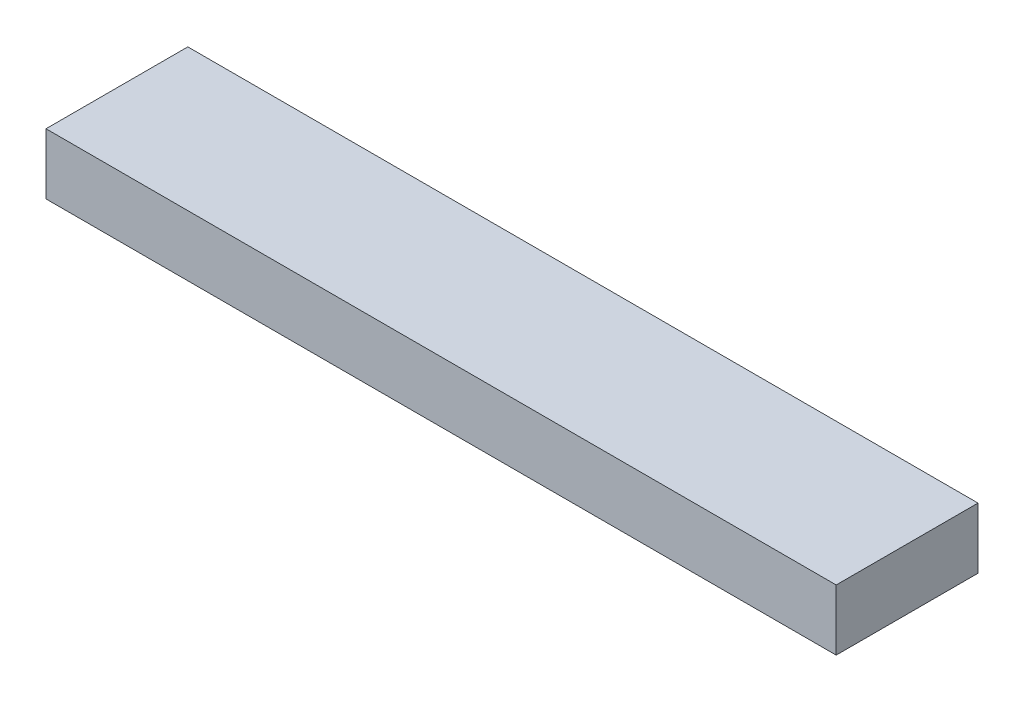
ISO-10303-21;
HEADER;
FILE_DESCRIPTION(('STEP AP214'),'2;1');
FILE_NAME('part.step','',(''),(''),'','','');
FILE_SCHEMA(('AUTOMOTIVE_DESIGN { 1 0 10303 214 1 1 1 1 }'));
ENDSEC;
DATA;
#1=APPLICATION_CONTEXT('core data for automotive mechanical design processes');
#2=APPLICATION_PROTOCOL_DEFINITION('international standard','automotive_design',2000,#1);
#3=PRODUCT_CONTEXT('',#1,'mechanical');
#4=PRODUCT('Part','Part','',(#3));
#5=PRODUCT_RELATED_PRODUCT_CATEGORY('part','',(#4));
#6=PRODUCT_DEFINITION_FORMATION('','',#4);
#7=PRODUCT_DEFINITION_CONTEXT('part definition',#1,'design');
#8=PRODUCT_DEFINITION('design','',#6,#7);
#9=PRODUCT_DEFINITION_SHAPE('','',#8);
#10=(LENGTH_UNIT() NAMED_UNIT(*) SI_UNIT(.MILLI.,.METRE.));
#11=(NAMED_UNIT(*) PLANE_ANGLE_UNIT() SI_UNIT($,.RADIAN.));
#12=(NAMED_UNIT(*) SI_UNIT($,.STERADIAN.) SOLID_ANGLE_UNIT());
#13=UNCERTAINTY_MEASURE_WITH_UNIT(LENGTH_MEASURE(1.E-05),#10,'distance_accuracy_value','');
#14=(GEOMETRIC_REPRESENTATION_CONTEXT(3) GLOBAL_UNCERTAINTY_ASSIGNED_CONTEXT((#13)) GLOBAL_UNIT_ASSIGNED_CONTEXT((#10,
#11,#12)) REPRESENTATION_CONTEXT('',''));
#15=CARTESIAN_POINT('',(0.,0.,0.));
#16=DIRECTION('',(0.,0.,1.));
#17=DIRECTION('',(1.,0.,0.));
#18=AXIS2_PLACEMENT_3D('',#15,#16,#17);
#19=CARTESIAN_POINT('',(0.,38.1,0.));
#20=DIRECTION('',(1.,0.,0.));
#21=DIRECTION('',(0.,0.,-1.));
#22=AXIS2_PLACEMENT_3D('',#19,#20,#21);
#23=PLANE('',#22);
#24=DIRECTION('',(0.,0.,1.));
#25=VECTOR('',#24,1.);
#26=CARTESIAN_POINT('',(0.,0.,0.));
#27=LINE('',#26,#25);
#28=CARTESIAN_POINT('',(0.,0.,-88.9));
#29=VERTEX_POINT('',#28);
#30=CARTESIAN_POINT('',(0.,0.,0.));
#31=VERTEX_POINT('',#30);
#32=EDGE_CURVE('E93',#29,#31,#27,.T.);
#33=ORIENTED_EDGE('',*,*,#32,.T.);
#34=DIRECTION('',(0.,-1.,0.));
#35=VECTOR('',#34,1.);
#36=CARTESIAN_POINT('',(0.,38.1,0.));
#37=LINE('',#36,#35);
#38=CARTESIAN_POINT('',(0.,38.1,0.));
#39=VERTEX_POINT('',#38);
#40=EDGE_CURVE('E11',#39,#31,#37,.T.);
#41=ORIENTED_EDGE('',*,*,#40,.F.);
#42=DIRECTION('',(0.,0.,1.));
#43=VECTOR('',#42,1.);
#44=CARTESIAN_POINT('',(0.,38.1,0.));
#45=LINE('',#44,#43);
#46=CARTESIAN_POINT('',(0.,38.1,-88.9));
#47=VERTEX_POINT('',#46);
#48=EDGE_CURVE('E81',#47,#39,#45,.T.);
#49=ORIENTED_EDGE('',*,*,#48,.F.);
#50=DIRECTION('',(0.,-1.,0.));
#51=VECTOR('',#50,1.);
#52=CARTESIAN_POINT('',(0.,38.1,-88.9));
#53=LINE('',#52,#51);
#54=EDGE_CURVE('E89',#47,#29,#53,.T.);
#55=ORIENTED_EDGE('',*,*,#54,.T.);
#56=EDGE_LOOP('',(#33,#41,#49,#55));
#57=FACE_BOUND('',#56,.T.);
#58=ADVANCED_FACE('F30',(#57),#23,.F.);
#59=CARTESIAN_POINT('',(0.,38.1,0.));
#60=DIRECTION('',(0.,0.,-1.));
#61=DIRECTION('',(-1.,0.,0.));
#62=AXIS2_PLACEMENT_3D('',#59,#60,#61);
#63=PLANE('',#62);
#64=DIRECTION('',(1.,0.,0.));
#65=VECTOR('',#64,1.);
#66=CARTESIAN_POINT('',(0.,0.,0.));
#67=LINE('',#66,#65);
#68=CARTESIAN_POINT('',(495.3,0.,0.));
#69=VERTEX_POINT('',#68);
#70=EDGE_CURVE('E85',#31,#69,#67,.T.);
#71=ORIENTED_EDGE('',*,*,#70,.T.);
#72=DIRECTION('',(0.,-1.,0.));
#73=VECTOR('',#72,1.);
#74=CARTESIAN_POINT('',(495.3,38.1,0.));
#75=LINE('',#74,#73);
#76=CARTESIAN_POINT('',(495.3,38.1,0.));
#77=VERTEX_POINT('',#76);
#78=EDGE_CURVE('E38',#77,#69,#75,.T.);
#79=ORIENTED_EDGE('',*,*,#78,.F.);
#80=DIRECTION('',(1.,0.,0.));
#81=VECTOR('',#80,1.);
#82=CARTESIAN_POINT('',(0.,38.1,0.));
#83=LINE('',#82,#81);
#84=EDGE_CURVE('E76',#39,#77,#83,.T.);
#85=ORIENTED_EDGE('',*,*,#84,.F.);
#86=ORIENTED_EDGE('',*,*,#40,.T.);
#87=EDGE_LOOP('',(#71,#79,#85,#86));
#88=FACE_BOUND('',#87,.T.);
#89=ADVANCED_FACE('F84',(#88),#63,.F.);
#90=CARTESIAN_POINT('',(495.3,38.1,0.));
#91=DIRECTION('',(-1.,0.,0.));
#92=DIRECTION('',(0.,0.,1.));
#93=AXIS2_PLACEMENT_3D('',#90,#91,#92);
#94=PLANE('',#93);
#95=DIRECTION('',(0.,0.,-1.));
#96=VECTOR('',#95,1.);
#97=CARTESIAN_POINT('',(495.3,0.,0.));
#98=LINE('',#97,#96);
#99=CARTESIAN_POINT('',(495.3,0.,-88.9));
#100=VERTEX_POINT('',#99);
#101=EDGE_CURVE('E63',#69,#100,#98,.T.);
#102=ORIENTED_EDGE('',*,*,#101,.T.);
#103=DIRECTION('',(0.,-1.,0.));
#104=VECTOR('',#103,1.);
#105=CARTESIAN_POINT('',(495.3,38.1,-88.9));
#106=LINE('',#105,#104);
#107=CARTESIAN_POINT('',(495.3,38.1,-88.9));
#108=VERTEX_POINT('',#107);
#109=EDGE_CURVE('E86',#108,#100,#106,.T.);
#110=ORIENTED_EDGE('',*,*,#109,.F.);
#111=DIRECTION('',(0.,0.,-1.));
#112=VECTOR('',#111,1.);
#113=CARTESIAN_POINT('',(495.3,38.1,0.));
#114=LINE('',#113,#112);
#115=EDGE_CURVE('E79',#77,#108,#114,.T.);
#116=ORIENTED_EDGE('',*,*,#115,.F.);
#117=ORIENTED_EDGE('',*,*,#78,.T.);
#118=EDGE_LOOP('',(#102,#110,#116,#117));
#119=FACE_BOUND('',#118,.T.);
#120=ADVANCED_FACE('F87',(#119),#94,.F.);
#121=CARTESIAN_POINT('',(0.,38.1,-88.9));
#122=DIRECTION('',(0.,0.,1.));
#123=DIRECTION('',(1.,0.,0.));
#124=AXIS2_PLACEMENT_3D('',#121,#122,#123);
#125=PLANE('',#124);
#126=DIRECTION('',(-1.,0.,0.));
#127=VECTOR('',#126,1.);
#128=CARTESIAN_POINT('',(0.,0.,-88.9));
#129=LINE('',#128,#127);
#130=EDGE_CURVE('E69',#100,#29,#129,.T.);
#131=ORIENTED_EDGE('',*,*,#130,.T.);
#132=ORIENTED_EDGE('',*,*,#54,.F.);
#133=DIRECTION('',(-1.,0.,0.));
#134=VECTOR('',#133,1.);
#135=CARTESIAN_POINT('',(0.,38.1,-88.9));
#136=LINE('',#135,#134);
#137=EDGE_CURVE('E46',#108,#47,#136,.T.);
#138=ORIENTED_EDGE('',*,*,#137,.F.);
#139=ORIENTED_EDGE('',*,*,#109,.T.);
#140=EDGE_LOOP('',(#131,#132,#138,#139));
#141=FACE_BOUND('',#140,.T.);
#142=ADVANCED_FACE('F100',(#141),#125,.F.);
#143=CARTESIAN_POINT('',(0.,38.1,-88.9));
#144=DIRECTION('',(0.,-1.,0.));
#145=DIRECTION('',(0.,0.,-1.));
#146=AXIS2_PLACEMENT_3D('',#143,#144,#145);
#147=PLANE('',#146);
#148=ORIENTED_EDGE('',*,*,#48,.T.);
#149=ORIENTED_EDGE('',*,*,#84,.T.);
#150=ORIENTED_EDGE('',*,*,#115,.T.);
#151=ORIENTED_EDGE('',*,*,#137,.T.);
#152=EDGE_LOOP('',(#148,#149,#150,#151));
#153=FACE_BOUND('',#152,.T.);
#154=ADVANCED_FACE('F77',(#153),#147,.F.);
#155=CARTESIAN_POINT('',(0.,0.,-88.9));
#156=DIRECTION('',(0.,-1.,0.));
#157=DIRECTION('',(0.,0.,-1.));
#158=AXIS2_PLACEMENT_3D('',#155,#156,#157);
#159=PLANE('',#158);
#160=ORIENTED_EDGE('',*,*,#32,.F.);
#161=ORIENTED_EDGE('',*,*,#130,.F.);
#162=ORIENTED_EDGE('',*,*,#101,.F.);
#163=ORIENTED_EDGE('',*,*,#70,.F.);
#164=EDGE_LOOP('',(#160,#161,#162,#163));
#165=FACE_BOUND('',#164,.T.);
#166=ADVANCED_FACE('F103',(#165),#159,.T.);
#167=CLOSED_SHELL('',(#58,#89,#120,#142,#154,#166));
#168=MANIFOLD_SOLID_BREP('B2',#167);
#169=ADVANCED_BREP_SHAPE_REPRESENTATION('',(#18,#168),#14);
#170=SHAPE_DEFINITION_REPRESENTATION(#9,#169);
ENDSEC;
END-ISO-10303-21;
